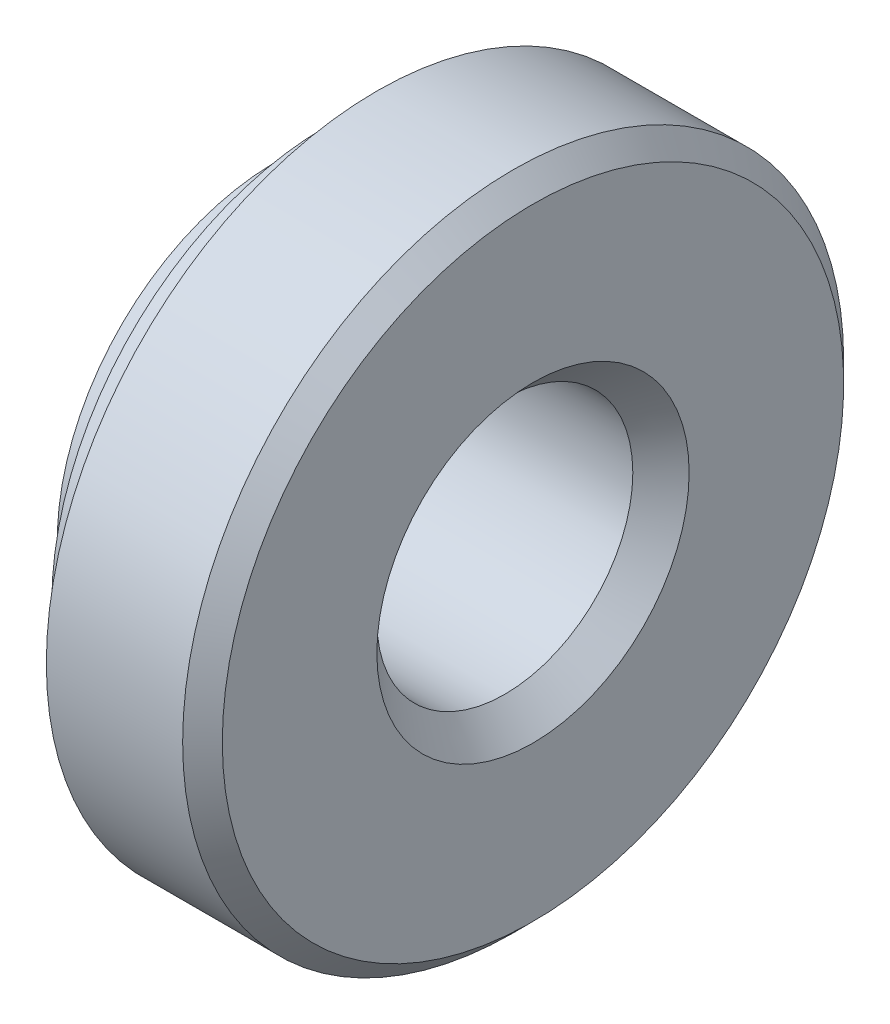
ISO-10303-21;
HEADER;
FILE_DESCRIPTION(('STEP AP214'),'2;1');
FILE_NAME('part.step','',(''),(''),'','','');
FILE_SCHEMA(('AUTOMOTIVE_DESIGN { 1 0 10303 214 1 1 1 1 }'));
ENDSEC;
DATA;
#1=APPLICATION_CONTEXT('core data for automotive mechanical design processes');
#2=APPLICATION_PROTOCOL_DEFINITION('international standard','automotive_design',2000,#1);
#3=PRODUCT_CONTEXT('',#1,'mechanical');
#4=PRODUCT('Part','Part','',(#3));
#5=PRODUCT_RELATED_PRODUCT_CATEGORY('part','',(#4));
#6=PRODUCT_DEFINITION_FORMATION('','',#4);
#7=PRODUCT_DEFINITION_CONTEXT('part definition',#1,'design');
#8=PRODUCT_DEFINITION('design','',#6,#7);
#9=PRODUCT_DEFINITION_SHAPE('','',#8);
#10=(LENGTH_UNIT() NAMED_UNIT(*) SI_UNIT(.MILLI.,.METRE.));
#11=(NAMED_UNIT(*) PLANE_ANGLE_UNIT() SI_UNIT($,.RADIAN.));
#12=(NAMED_UNIT(*) SI_UNIT($,.STERADIAN.) SOLID_ANGLE_UNIT());
#13=UNCERTAINTY_MEASURE_WITH_UNIT(LENGTH_MEASURE(1.E-05),#10,'distance_accuracy_value','');
#14=(GEOMETRIC_REPRESENTATION_CONTEXT(3) GLOBAL_UNCERTAINTY_ASSIGNED_CONTEXT((#13)) GLOBAL_UNIT_ASSIGNED_CONTEXT((#10,
#11,#12)) REPRESENTATION_CONTEXT('',''));
#15=CARTESIAN_POINT('',(0.,0.,0.));
#16=DIRECTION('',(0.,0.,1.));
#17=DIRECTION('',(1.,0.,0.));
#18=AXIS2_PLACEMENT_3D('',#15,#16,#17);
#19=CARTESIAN_POINT('',(0.223846154028707,0.,0.));
#20=DIRECTION('',(-1.,0.,0.));
#21=DIRECTION('',(0.,0.,1.));
#22=AXIS2_PLACEMENT_3D('',#19,#20,#21);
#23=CONICAL_SURFACE('',#22,2.09999999997024,0.133226751625499);
#24=CARTESIAN_POINT('',(0.223846153846154,0.,0.));
#25=DIRECTION('',(1.,0.,0.));
#26=DIRECTION('',(0.,0.,-1.));
#27=AXIS2_PLACEMENT_3D('',#24,#25,#26);
#28=CIRCLE('',#27,2.1);
#29=CARTESIAN_POINT('',(0.223846153846155,0.,-2.1));
#30=VERTEX_POINT('',#29);
#31=EDGE_CURVE('E31',#30,#30,#28,.F.);
#32=ORIENTED_EDGE('',*,*,#31,.F.);
#33=EDGE_LOOP('',(#32));
#34=FACE_BOUND('',#33,.T.);
#35=CARTESIAN_POINT('',(0.484999999969204,0.,0.));
#36=DIRECTION('',(-1.,0.,0.));
#37=DIRECTION('',(0.,0.,1.));
#38=AXIS2_PLACEMENT_3D('',#35,#36,#37);
#39=CIRCLE('',#38,2.06500000000279);
#40=CARTESIAN_POINT('',(0.484999999969204,0.,2.06500000000279));
#41=VERTEX_POINT('',#40);
#42=EDGE_CURVE('E19',#41,#41,#39,.F.);
#43=ORIENTED_EDGE('',*,*,#42,.F.);
#44=EDGE_LOOP('',(#43));
#45=FACE_BOUND('',#44,.T.);
#46=ADVANCED_FACE('F16',(#34,#45),#23,.T.);
#47=CARTESIAN_POINT('',(0.111923076923077,0.,0.));
#48=DIRECTION('',(1.,0.,0.));
#49=DIRECTION('',(0.,0.,-1.));
#50=AXIS2_PLACEMENT_3D('',#47,#48,#49);
#51=CYLINDRICAL_SURFACE('',#50,2.1);
#52=ORIENTED_EDGE('',*,*,#31,.T.);
#53=EDGE_LOOP('',(#52));
#54=FACE_BOUND('',#53,.T.);
#55=CARTESIAN_POINT('',(0.,0.,0.));
#56=DIRECTION('',(1.,0.,0.));
#57=DIRECTION('',(0.,0.,-1.));
#58=AXIS2_PLACEMENT_3D('',#55,#56,#57);
#59=CIRCLE('',#58,2.1);
#60=CARTESIAN_POINT('',(0.,0.,-2.1));
#61=VERTEX_POINT('',#60);
#62=EDGE_CURVE('E47',#61,#61,#59,.F.);
#63=ORIENTED_EDGE('',*,*,#62,.F.);
#64=EDGE_LOOP('',(#63));
#65=FACE_BOUND('',#64,.T.);
#66=ADVANCED_FACE('F57',(#54,#65),#51,.T.);
#67=CARTESIAN_POINT('',(0.485,0.,0.));
#68=DIRECTION('',(-1.,0.,0.));
#69=DIRECTION('',(0.,0.,1.));
#70=AXIS2_PLACEMENT_3D('',#67,#68,#69);
#71=PLANE('',#70);
#72=CARTESIAN_POINT('',(0.485,0.,0.));
#73=DIRECTION('',(-1.,0.,0.));
#74=DIRECTION('',(0.,0.,1.));
#75=AXIS2_PLACEMENT_3D('',#72,#73,#74);
#76=CIRCLE('',#75,2.6375);
#77=CARTESIAN_POINT('',(0.485,0.,2.6375));
#78=VERTEX_POINT('',#77);
#79=EDGE_CURVE('E45',#78,#78,#76,.F.);
#80=ORIENTED_EDGE('',*,*,#79,.F.);
#81=EDGE_LOOP('',(#80));
#82=FACE_BOUND('',#81,.T.);
#83=ORIENTED_EDGE('',*,*,#42,.T.);
#84=EDGE_LOOP('',(#83));
#85=FACE_BOUND('',#84,.T.);
#86=ADVANCED_FACE('F66',(#82,#85),#71,.T.);
#87=CARTESIAN_POINT('',(0.,0.,1.05));
#88=DIRECTION('',(-1.,0.,0.));
#89=DIRECTION('',(0.,0.,1.));
#90=AXIS2_PLACEMENT_3D('',#87,#88,#89);
#91=PLANE('',#90);
#92=ORIENTED_EDGE('',*,*,#62,.T.);
#93=EDGE_LOOP('',(#92));
#94=FACE_BOUND('',#93,.T.);
#95=CARTESIAN_POINT('',(0.,0.,0.));
#96=DIRECTION('',(-1.,0.,0.));
#97=DIRECTION('',(0.,-1.,0.));
#98=AXIS2_PLACEMENT_3D('',#95,#96,#97);
#99=CIRCLE('',#98,1.50000000002137);
#100=CARTESIAN_POINT('',(0.,-1.50000000002137,0.));
#101=VERTEX_POINT('',#100);
#102=EDGE_CURVE('E42',#101,#101,#99,.F.);
#103=ORIENTED_EDGE('',*,*,#102,.T.);
#104=EDGE_LOOP('',(#103));
#105=FACE_BOUND('',#104,.T.);
#106=ADVANCED_FACE('F101',(#94,#105),#91,.T.);
#107=CARTESIAN_POINT('',(0.7275,0.,0.));
#108=DIRECTION('',(-1.,0.,0.));
#109=DIRECTION('',(0.,0.,1.));
#110=AXIS2_PLACEMENT_3D('',#107,#108,#109);
#111=CYLINDRICAL_SURFACE('',#110,2.6375);
#112=CARTESIAN_POINT('',(0.97,0.,0.));
#113=DIRECTION('',(-1.,0.,0.));
#114=DIRECTION('',(0.,0.,1.));
#115=AXIS2_PLACEMENT_3D('',#112,#113,#114);
#116=CIRCLE('',#115,2.6375);
#117=CARTESIAN_POINT('',(0.969999999999999,0.,2.6375));
#118=VERTEX_POINT('',#117);
#119=EDGE_CURVE('E39',#118,#118,#116,.F.);
#120=ORIENTED_EDGE('',*,*,#119,.F.);
#121=EDGE_LOOP('',(#120));
#122=FACE_BOUND('',#121,.T.);
#123=ORIENTED_EDGE('',*,*,#79,.T.);
#124=EDGE_LOOP('',(#123));
#125=FACE_BOUND('',#124,.T.);
#126=ADVANCED_FACE('F97',(#122,#125),#111,.T.);
#127=CARTESIAN_POINT('',(0.,0.,0.));
#128=DIRECTION('',(-1.,0.,0.));
#129=DIRECTION('',(0.,-1.,0.));
#130=AXIS2_PLACEMENT_3D('',#127,#128,#129);
#131=CONICAL_SURFACE('',#130,1.50000000002137,0.785398163397448);
#132=ORIENTED_EDGE('',*,*,#102,.F.);
#133=EDGE_LOOP('',(#132));
#134=FACE_BOUND('',#133,.T.);
#135=CARTESIAN_POINT('',(0.2705,0.,0.));
#136=DIRECTION('',(-1.,0.,0.));
#137=DIRECTION('',(0.,-1.,0.));
#138=AXIS2_PLACEMENT_3D('',#135,#136,#137);
#139=CIRCLE('',#138,1.2295);
#140=CARTESIAN_POINT('',(0.2705,-1.2295,0.));
#141=VERTEX_POINT('',#140);
#142=EDGE_CURVE('E38',#141,#141,#139,.F.);
#143=ORIENTED_EDGE('',*,*,#142,.T.);
#144=EDGE_LOOP('',(#143));
#145=FACE_BOUND('',#144,.T.);
#146=ADVANCED_FACE('F93',(#134,#145),#131,.F.);
#147=CARTESIAN_POINT('',(0.969999999999999,0.,1.5875));
#148=DIRECTION('',(-1.,0.,0.));
#149=DIRECTION('',(0.,0.,1.));
#150=AXIS2_PLACEMENT_3D('',#147,#148,#149);
#151=PLANE('',#150);
#152=CARTESIAN_POINT('',(0.969999999999999,0.,0.));
#153=DIRECTION('',(1.,0.,0.));
#154=DIRECTION('',(0.,0.,-1.));
#155=AXIS2_PLACEMENT_3D('',#152,#153,#154);
#156=CIRCLE('',#155,3.175);
#157=CARTESIAN_POINT('',(0.97,0.,-3.175));
#158=VERTEX_POINT('',#157);
#159=EDGE_CURVE('E34',#158,#158,#156,.T.);
#160=ORIENTED_EDGE('',*,*,#159,.F.);
#161=EDGE_LOOP('',(#160));
#162=FACE_BOUND('',#161,.T.);
#163=ORIENTED_EDGE('',*,*,#119,.T.);
#164=EDGE_LOOP('',(#163));
#165=FACE_BOUND('',#164,.T.);
#166=ADVANCED_FACE('F89',(#162,#165),#151,.T.);
#167=CARTESIAN_POINT('',(1.235,0.,0.));
#168=DIRECTION('',(-1.,0.,0.));
#169=DIRECTION('',(0.,-1.,0.));
#170=AXIS2_PLACEMENT_3D('',#167,#168,#169);
#171=CYLINDRICAL_SURFACE('',#170,1.2295);
#172=ORIENTED_EDGE('',*,*,#142,.F.);
#173=EDGE_LOOP('',(#172));
#174=FACE_BOUND('',#173,.T.);
#175=CARTESIAN_POINT('',(2.19950000001745,0.,0.));
#176=DIRECTION('',(1.,0.,0.));
#177=DIRECTION('',(0.,0.,1.));
#178=AXIS2_PLACEMENT_3D('',#175,#176,#177);
#179=CIRCLE('',#178,1.22949999996536);
#180=CARTESIAN_POINT('',(2.19950000001745,0.,1.22949999996536));
#181=VERTEX_POINT('',#180);
#182=EDGE_CURVE('E37',#181,#181,#179,.T.);
#183=ORIENTED_EDGE('',*,*,#182,.T.);
#184=EDGE_LOOP('',(#183));
#185=FACE_BOUND('',#184,.T.);
#186=ADVANCED_FACE('F85',(#174,#185),#171,.F.);
#187=CARTESIAN_POINT('',(1.62475,0.,0.));
#188=DIRECTION('',(1.,0.,0.));
#189=DIRECTION('',(0.,0.,-1.));
#190=AXIS2_PLACEMENT_3D('',#187,#188,#189);
#191=CYLINDRICAL_SURFACE('',#190,3.175);
#192=CARTESIAN_POINT('',(2.279499999986,0.,0.));
#193=DIRECTION('',(-1.,0.,0.));
#194=DIRECTION('',(0.,0.,1.));
#195=AXIS2_PLACEMENT_3D('',#192,#193,#194);
#196=CIRCLE('',#195,3.17500000005566);
#197=CARTESIAN_POINT('',(2.279499999986,-1.30806854090831E-13,3.17500000005566));
#198=VERTEX_POINT('',#197);
#199=EDGE_CURVE('E28',#198,#198,#196,.F.);
#200=ORIENTED_EDGE('',*,*,#199,.F.);
#201=EDGE_LOOP('',(#200));
#202=FACE_BOUND('',#201,.T.);
#203=ORIENTED_EDGE('',*,*,#159,.T.);
#204=EDGE_LOOP('',(#203));
#205=FACE_BOUND('',#204,.T.);
#206=ADVANCED_FACE('F81',(#202,#205),#191,.T.);
#207=CARTESIAN_POINT('',(2.47000000001663,0.,0.));
#208=DIRECTION('',(1.,0.,0.));
#209=DIRECTION('',(0.,0.,-1.));
#210=AXIS2_PLACEMENT_3D('',#207,#208,#209);
#211=CONICAL_SURFACE('',#210,1.49999999996453,0.785398163292377);
#212=ORIENTED_EDGE('',*,*,#182,.F.);
#213=EDGE_LOOP('',(#212));
#214=FACE_BOUND('',#213,.T.);
#215=CARTESIAN_POINT('',(2.47000000007347,0.,0.));
#216=DIRECTION('',(1.,0.,0.));
#217=DIRECTION('',(0.,0.,-1.));
#218=AXIS2_PLACEMENT_3D('',#215,#216,#217);
#219=CIRCLE('',#218,1.50000000002137);
#220=CARTESIAN_POINT('',(2.47000000007347,0.,-1.50000000002137));
#221=VERTEX_POINT('',#220);
#222=EDGE_CURVE('E23',#221,#221,#219,.F.);
#223=ORIENTED_EDGE('',*,*,#222,.F.);
#224=EDGE_LOOP('',(#223));
#225=FACE_BOUND('',#224,.T.);
#226=ADVANCED_FACE('F74',(#214,#225),#211,.F.);
#227=CARTESIAN_POINT('',(2.279499999986,0.,0.));
#228=DIRECTION('',(-1.,0.,0.));
#229=DIRECTION('',(0.,0.,1.));
#230=AXIS2_PLACEMENT_3D('',#227,#228,#229);
#231=CONICAL_SURFACE('',#230,3.17500000005566,0.78539816339745);
#232=CARTESIAN_POINT('',(2.47000000013031,0.,0.));
#233=DIRECTION('',(-1.,0.,0.));
#234=DIRECTION('',(0.,0.,1.));
#235=AXIS2_PLACEMENT_3D('',#232,#233,#234);
#236=CIRCLE('',#235,2.98449999991135);
#237=CARTESIAN_POINT('',(2.47000000013031,0.,2.98449999991135));
#238=VERTEX_POINT('',#237);
#239=EDGE_CURVE('E10',#238,#238,#236,.F.);
#240=ORIENTED_EDGE('',*,*,#239,.F.);
#241=EDGE_LOOP('',(#240));
#242=FACE_BOUND('',#241,.T.);
#243=ORIENTED_EDGE('',*,*,#199,.T.);
#244=EDGE_LOOP('',(#243));
#245=FACE_BOUND('',#244,.T.);
#246=ADVANCED_FACE('F69',(#242,#245),#231,.T.);
#247=CARTESIAN_POINT('',(2.47,0.,1.49225));
#248=DIRECTION('',(1.,0.,0.));
#249=DIRECTION('',(0.,0.,-1.));
#250=AXIS2_PLACEMENT_3D('',#247,#248,#249);
#251=PLANE('',#250);
#252=ORIENTED_EDGE('',*,*,#239,.T.);
#253=EDGE_LOOP('',(#252));
#254=FACE_BOUND('',#253,.T.);
#255=ORIENTED_EDGE('',*,*,#222,.T.);
#256=EDGE_LOOP('',(#255));
#257=FACE_BOUND('',#256,.T.);
#258=ADVANCED_FACE('F67',(#254,#257),#251,.T.);
#259=CLOSED_SHELL('',(#46,#66,#86,#106,#126,#146,#166,#186,#206,#226,#246,#258));
#260=MANIFOLD_SOLID_BREP('B1',#259);
#261=ADVANCED_BREP_SHAPE_REPRESENTATION('',(#18,#260),#14);
#262=SHAPE_DEFINITION_REPRESENTATION(#9,#261);
ENDSEC;
END-ISO-10303-21;
